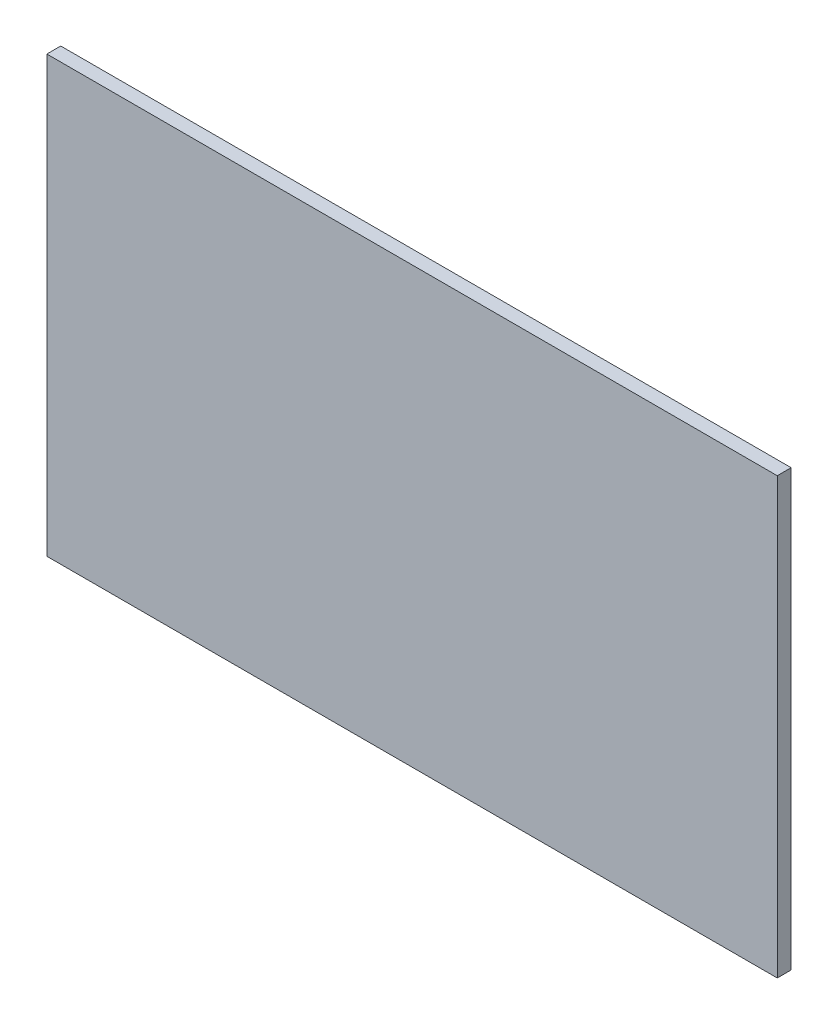
ISO-10303-21;
HEADER;
FILE_DESCRIPTION(('STEP AP214'),'2;1');
FILE_NAME('part.step','',(''),(''),'','','');
FILE_SCHEMA(('AUTOMOTIVE_DESIGN { 1 0 10303 214 1 1 1 1 }'));
ENDSEC;
DATA;
#1=APPLICATION_CONTEXT('core data for automotive mechanical design processes');
#2=APPLICATION_PROTOCOL_DEFINITION('international standard','automotive_design',2000,#1);
#3=PRODUCT_CONTEXT('',#1,'mechanical');
#4=PRODUCT('Part','Part','',(#3));
#5=PRODUCT_RELATED_PRODUCT_CATEGORY('part','',(#4));
#6=PRODUCT_DEFINITION_FORMATION('','',#4);
#7=PRODUCT_DEFINITION_CONTEXT('part definition',#1,'design');
#8=PRODUCT_DEFINITION('design','',#6,#7);
#9=PRODUCT_DEFINITION_SHAPE('','',#8);
#10=(LENGTH_UNIT() NAMED_UNIT(*) SI_UNIT(.MILLI.,.METRE.));
#11=(NAMED_UNIT(*) PLANE_ANGLE_UNIT() SI_UNIT($,.RADIAN.));
#12=(NAMED_UNIT(*) SI_UNIT($,.STERADIAN.) SOLID_ANGLE_UNIT());
#13=UNCERTAINTY_MEASURE_WITH_UNIT(LENGTH_MEASURE(1.E-05),#10,'distance_accuracy_value','');
#14=(GEOMETRIC_REPRESENTATION_CONTEXT(3) GLOBAL_UNCERTAINTY_ASSIGNED_CONTEXT((#13)) GLOBAL_UNIT_ASSIGNED_CONTEXT((#10,
#11,#12)) REPRESENTATION_CONTEXT('',''));
#15=CARTESIAN_POINT('',(0.,0.,0.));
#16=DIRECTION('',(0.,0.,1.));
#17=DIRECTION('',(1.,0.,0.));
#18=AXIS2_PLACEMENT_3D('',#15,#16,#17);
#19=CARTESIAN_POINT('',(-473.5,-282.,18.));
#20=DIRECTION('',(1.,0.,0.));
#21=DIRECTION('',(0.,0.,-1.));
#22=AXIS2_PLACEMENT_3D('',#19,#20,#21);
#23=PLANE('',#22);
#24=DIRECTION('',(0.,-1.,0.));
#25=VECTOR('',#24,1.);
#26=CARTESIAN_POINT('',(-473.5,-282.,0.));
#27=LINE('',#26,#25);
#28=CARTESIAN_POINT('',(-473.5,282.,0.));
#29=VERTEX_POINT('',#28);
#30=CARTESIAN_POINT('',(-473.5,-282.,0.));
#31=VERTEX_POINT('',#30);
#32=EDGE_CURVE('E96',#29,#31,#27,.T.);
#33=ORIENTED_EDGE('',*,*,#32,.T.);
#34=DIRECTION('',(0.,0.,-1.));
#35=VECTOR('',#34,1.);
#36=CARTESIAN_POINT('',(-473.5,-282.,18.));
#37=LINE('',#36,#35);
#38=CARTESIAN_POINT('',(-473.5,-282.,18.));
#39=VERTEX_POINT('',#38);
#40=EDGE_CURVE('E11',#39,#31,#37,.T.);
#41=ORIENTED_EDGE('',*,*,#40,.F.);
#42=DIRECTION('',(0.,-1.,0.));
#43=VECTOR('',#42,1.);
#44=CARTESIAN_POINT('',(-473.5,-282.,18.));
#45=LINE('',#44,#43);
#46=CARTESIAN_POINT('',(-473.5,282.,18.));
#47=VERTEX_POINT('',#46);
#48=EDGE_CURVE('E84',#47,#39,#45,.T.);
#49=ORIENTED_EDGE('',*,*,#48,.F.);
#50=DIRECTION('',(0.,0.,-1.));
#51=VECTOR('',#50,1.);
#52=CARTESIAN_POINT('',(-473.5,282.,18.));
#53=LINE('',#52,#51);
#54=EDGE_CURVE('E92',#47,#29,#53,.T.);
#55=ORIENTED_EDGE('',*,*,#54,.T.);
#56=EDGE_LOOP('',(#33,#41,#49,#55));
#57=FACE_BOUND('',#56,.T.);
#58=ADVANCED_FACE('F33',(#57),#23,.F.);
#59=CARTESIAN_POINT('',(473.5,-282.,18.));
#60=DIRECTION('',(0.,1.,0.));
#61=DIRECTION('',(-1.,0.,0.));
#62=AXIS2_PLACEMENT_3D('',#59,#60,#61);
#63=PLANE('',#62);
#64=DIRECTION('',(1.,0.,0.));
#65=VECTOR('',#64,1.);
#66=CARTESIAN_POINT('',(473.5,-282.,0.));
#67=LINE('',#66,#65);
#68=CARTESIAN_POINT('',(473.5,-282.,0.));
#69=VERTEX_POINT('',#68);
#70=EDGE_CURVE('E88',#31,#69,#67,.T.);
#71=ORIENTED_EDGE('',*,*,#70,.T.);
#72=DIRECTION('',(0.,0.,-1.));
#73=VECTOR('',#72,1.);
#74=CARTESIAN_POINT('',(473.5,-282.,18.));
#75=LINE('',#74,#73);
#76=CARTESIAN_POINT('',(473.5,-282.,18.));
#77=VERTEX_POINT('',#76);
#78=EDGE_CURVE('E41',#77,#69,#75,.T.);
#79=ORIENTED_EDGE('',*,*,#78,.F.);
#80=DIRECTION('',(1.,0.,0.));
#81=VECTOR('',#80,1.);
#82=CARTESIAN_POINT('',(473.5,-282.,18.));
#83=LINE('',#82,#81);
#84=EDGE_CURVE('E79',#39,#77,#83,.T.);
#85=ORIENTED_EDGE('',*,*,#84,.F.);
#86=ORIENTED_EDGE('',*,*,#40,.T.);
#87=EDGE_LOOP('',(#71,#79,#85,#86));
#88=FACE_BOUND('',#87,.T.);
#89=ADVANCED_FACE('F87',(#88),#63,.F.);
#90=CARTESIAN_POINT('',(473.5,-282.,18.));
#91=DIRECTION('',(-1.,0.,0.));
#92=DIRECTION('',(0.,0.,1.));
#93=AXIS2_PLACEMENT_3D('',#90,#91,#92);
#94=PLANE('',#93);
#95=DIRECTION('',(0.,1.,0.));
#96=VECTOR('',#95,1.);
#97=CARTESIAN_POINT('',(473.5,-282.,0.));
#98=LINE('',#97,#96);
#99=CARTESIAN_POINT('',(473.5,282.,0.));
#100=VERTEX_POINT('',#99);
#101=EDGE_CURVE('E66',#69,#100,#98,.T.);
#102=ORIENTED_EDGE('',*,*,#101,.T.);
#103=DIRECTION('',(0.,0.,-1.));
#104=VECTOR('',#103,1.);
#105=CARTESIAN_POINT('',(473.5,282.,18.));
#106=LINE('',#105,#104);
#107=CARTESIAN_POINT('',(473.5,282.,18.));
#108=VERTEX_POINT('',#107);
#109=EDGE_CURVE('E89',#108,#100,#106,.T.);
#110=ORIENTED_EDGE('',*,*,#109,.F.);
#111=DIRECTION('',(0.,1.,0.));
#112=VECTOR('',#111,1.);
#113=CARTESIAN_POINT('',(473.5,-282.,18.));
#114=LINE('',#113,#112);
#115=EDGE_CURVE('E82',#77,#108,#114,.T.);
#116=ORIENTED_EDGE('',*,*,#115,.F.);
#117=ORIENTED_EDGE('',*,*,#78,.T.);
#118=EDGE_LOOP('',(#102,#110,#116,#117));
#119=FACE_BOUND('',#118,.T.);
#120=ADVANCED_FACE('F90',(#119),#94,.F.);
#121=CARTESIAN_POINT('',(473.5,282.,18.));
#122=DIRECTION('',(0.,-1.,0.));
#123=DIRECTION('',(1.,0.,0.));
#124=AXIS2_PLACEMENT_3D('',#121,#122,#123);
#125=PLANE('',#124);
#126=DIRECTION('',(-1.,0.,0.));
#127=VECTOR('',#126,1.);
#128=CARTESIAN_POINT('',(473.5,282.,0.));
#129=LINE('',#128,#127);
#130=EDGE_CURVE('E72',#100,#29,#129,.T.);
#131=ORIENTED_EDGE('',*,*,#130,.T.);
#132=ORIENTED_EDGE('',*,*,#54,.F.);
#133=DIRECTION('',(-1.,0.,0.));
#134=VECTOR('',#133,1.);
#135=CARTESIAN_POINT('',(473.5,282.,18.));
#136=LINE('',#135,#134);
#137=EDGE_CURVE('E49',#108,#47,#136,.T.);
#138=ORIENTED_EDGE('',*,*,#137,.F.);
#139=ORIENTED_EDGE('',*,*,#109,.T.);
#140=EDGE_LOOP('',(#131,#132,#138,#139));
#141=FACE_BOUND('',#140,.T.);
#142=ADVANCED_FACE('F103',(#141),#125,.F.);
#143=CARTESIAN_POINT('',(0.,0.,18.));
#144=DIRECTION('',(0.,0.,1.));
#145=DIRECTION('',(1.,0.,0.));
#146=AXIS2_PLACEMENT_3D('',#143,#144,#145);
#147=PLANE('',#146);
#148=ORIENTED_EDGE('',*,*,#48,.T.);
#149=ORIENTED_EDGE('',*,*,#84,.T.);
#150=ORIENTED_EDGE('',*,*,#115,.T.);
#151=ORIENTED_EDGE('',*,*,#137,.T.);
#152=EDGE_LOOP('',(#148,#149,#150,#151));
#153=FACE_BOUND('',#152,.T.);
#154=ADVANCED_FACE('F80',(#153),#147,.T.);
#155=CARTESIAN_POINT('',(0.,0.,0.));
#156=DIRECTION('',(0.,0.,1.));
#157=DIRECTION('',(1.,0.,0.));
#158=AXIS2_PLACEMENT_3D('',#155,#156,#157);
#159=PLANE('',#158);
#160=ORIENTED_EDGE('',*,*,#32,.F.);
#161=ORIENTED_EDGE('',*,*,#130,.F.);
#162=ORIENTED_EDGE('',*,*,#101,.F.);
#163=ORIENTED_EDGE('',*,*,#70,.F.);
#164=EDGE_LOOP('',(#160,#161,#162,#163));
#165=FACE_BOUND('',#164,.T.);
#166=ADVANCED_FACE('F106',(#165),#159,.F.);
#167=CLOSED_SHELL('',(#58,#89,#120,#142,#154,#166));
#168=MANIFOLD_SOLID_BREP('B2',#167);
#169=ADVANCED_BREP_SHAPE_REPRESENTATION('',(#18,#168),#14);
#170=SHAPE_DEFINITION_REPRESENTATION(#9,#169);
ENDSEC;
END-ISO-10303-21;
